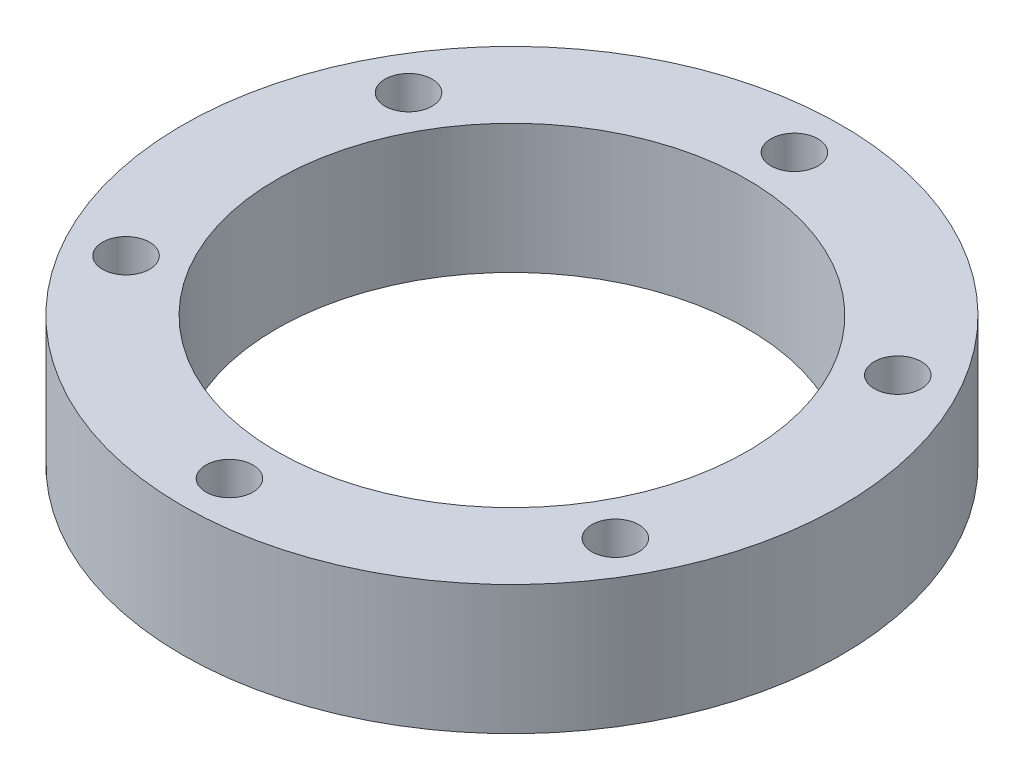
ISO-10303-21;
HEADER;
FILE_DESCRIPTION(('STEP AP214'),'2;1');
FILE_NAME('part.step','',(''),(''),'','','');
FILE_SCHEMA(('AUTOMOTIVE_DESIGN { 1 0 10303 214 1 1 1 1 }'));
ENDSEC;
DATA;
#1=APPLICATION_CONTEXT('core data for automotive mechanical design processes');
#2=APPLICATION_PROTOCOL_DEFINITION('international standard','automotive_design',2000,#1);
#3=PRODUCT_CONTEXT('',#1,'mechanical');
#4=PRODUCT('Part','Part','',(#3));
#5=PRODUCT_RELATED_PRODUCT_CATEGORY('part','',(#4));
#6=PRODUCT_DEFINITION_FORMATION('','',#4);
#7=PRODUCT_DEFINITION_CONTEXT('part definition',#1,'design');
#8=PRODUCT_DEFINITION('design','',#6,#7);
#9=PRODUCT_DEFINITION_SHAPE('','',#8);
#10=(LENGTH_UNIT() NAMED_UNIT(*) SI_UNIT(.MILLI.,.METRE.));
#11=(NAMED_UNIT(*) PLANE_ANGLE_UNIT() SI_UNIT($,.RADIAN.));
#12=(NAMED_UNIT(*) SI_UNIT($,.STERADIAN.) SOLID_ANGLE_UNIT());
#13=UNCERTAINTY_MEASURE_WITH_UNIT(LENGTH_MEASURE(1.E-05),#10,'distance_accuracy_value','');
#14=(GEOMETRIC_REPRESENTATION_CONTEXT(3) GLOBAL_UNCERTAINTY_ASSIGNED_CONTEXT((#13)) GLOBAL_UNIT_ASSIGNED_CONTEXT((#10,
#11,#12)) REPRESENTATION_CONTEXT('',''));
#15=CARTESIAN_POINT('',(0.,0.,0.));
#16=DIRECTION('',(0.,0.,1.));
#17=DIRECTION('',(1.,0.,0.));
#18=AXIS2_PLACEMENT_3D('',#15,#16,#17);
#19=CARTESIAN_POINT('',(0.,6.86,0.));
#20=DIRECTION('',(0.,-1.,0.));
#21=DIRECTION('',(0.,0.,-1.));
#22=AXIS2_PLACEMENT_3D('',#19,#20,#21);
#23=CYLINDRICAL_SURFACE('',#22,17.5);
#24=CARTESIAN_POINT('',(0.,6.86,0.));
#25=DIRECTION('',(0.,1.,0.));
#26=DIRECTION('',(0.,0.,1.));
#27=AXIS2_PLACEMENT_3D('',#24,#25,#26);
#28=CIRCLE('',#27,17.5);
#29=CARTESIAN_POINT('',(0.,6.86,17.5));
#30=VERTEX_POINT('',#29);
#31=EDGE_CURVE('E10',#30,#30,#28,.T.);
#32=ORIENTED_EDGE('',*,*,#31,.F.);
#33=EDGE_LOOP('',(#32));
#34=FACE_BOUND('',#33,.T.);
#35=CARTESIAN_POINT('',(0.,0.,0.));
#36=DIRECTION('',(0.,1.,0.));
#37=DIRECTION('',(0.,0.,1.));
#38=AXIS2_PLACEMENT_3D('',#35,#36,#37);
#39=CIRCLE('',#38,17.5);
#40=CARTESIAN_POINT('',(0.,0.,17.5));
#41=VERTEX_POINT('',#40);
#42=EDGE_CURVE('E34',#41,#41,#39,.T.);
#43=ORIENTED_EDGE('',*,*,#42,.T.);
#44=EDGE_LOOP('',(#43));
#45=FACE_BOUND('',#44,.T.);
#46=ADVANCED_FACE('F31',(#34,#45),#23,.T.);
#47=CARTESIAN_POINT('',(0.,6.86,0.));
#48=DIRECTION('',(0.,1.,0.));
#49=DIRECTION('',(0.,0.,1.));
#50=AXIS2_PLACEMENT_3D('',#47,#48,#49);
#51=PLANE('',#50);
#52=CARTESIAN_POINT('',(-12.9903810567665,6.86,-7.50000000000015));
#53=DIRECTION('',(0.,1.,0.));
#54=DIRECTION('',(0.866025403784433,0.,0.50000000000001));
#55=AXIS2_PLACEMENT_3D('',#52,#53,#54);
#56=CIRCLE('',#55,1.25);
#57=CARTESIAN_POINT('',(-11.907849302036,6.86,-6.87500000000014));
#58=VERTEX_POINT('',#57);
#59=EDGE_CURVE('E61',#58,#58,#56,.T.);
#60=ORIENTED_EDGE('',*,*,#59,.F.);
#61=EDGE_LOOP('',(#60));
#62=FACE_BOUND('',#61,.T.);
#63=CARTESIAN_POINT('',(-12.9903810567666,6.86,7.49999999999988));
#64=DIRECTION('',(0.,1.,0.));
#65=DIRECTION('',(0.866025403784443,0.,-0.499999999999992));
#66=AXIS2_PLACEMENT_3D('',#63,#64,#65);
#67=CIRCLE('',#66,1.25);
#68=CARTESIAN_POINT('',(-11.9078493020361,6.86,6.87499999999989));
#69=VERTEX_POINT('',#68);
#70=EDGE_CURVE('E67',#69,#69,#67,.T.);
#71=ORIENTED_EDGE('',*,*,#70,.F.);
#72=EDGE_LOOP('',(#71));
#73=FACE_BOUND('',#72,.T.);
#74=CARTESIAN_POINT('',(0.,6.86,15.));
#75=DIRECTION('',(0.,1.,0.));
#76=DIRECTION('',(0.,0.,-1.));
#77=AXIS2_PLACEMENT_3D('',#74,#75,#76);
#78=CIRCLE('',#77,1.25);
#79=CARTESIAN_POINT('',(0.,6.86,13.75));
#80=VERTEX_POINT('',#79);
#81=EDGE_CURVE('E73',#80,#80,#78,.T.);
#82=ORIENTED_EDGE('',*,*,#81,.F.);
#83=EDGE_LOOP('',(#82));
#84=FACE_BOUND('',#83,.T.);
#85=CARTESIAN_POINT('',(12.9903810567665,6.86,7.50000000000006));
#86=DIRECTION('',(0.,1.,0.));
#87=DIRECTION('',(-0.866025403784436,0.,-0.500000000000004));
#88=AXIS2_PLACEMENT_3D('',#85,#86,#87);
#89=CIRCLE('',#88,1.25);
#90=CARTESIAN_POINT('',(11.907849302036,6.86,6.87500000000006));
#91=VERTEX_POINT('',#90);
#92=EDGE_CURVE('E79',#91,#91,#89,.T.);
#93=ORIENTED_EDGE('',*,*,#92,.F.);
#94=EDGE_LOOP('',(#93));
#95=FACE_BOUND('',#94,.T.);
#96=CARTESIAN_POINT('',(12.9903810567666,6.86,-7.49999999999997));
#97=DIRECTION('',(0.,1.,0.));
#98=DIRECTION('',(-0.86602540378444,0.,0.499999999999998));
#99=AXIS2_PLACEMENT_3D('',#96,#97,#98);
#100=CIRCLE('',#99,1.25);
#101=CARTESIAN_POINT('',(11.907849302036,6.86,-6.87499999999997));
#102=VERTEX_POINT('',#101);
#103=EDGE_CURVE('E55',#102,#102,#100,.T.);
#104=ORIENTED_EDGE('',*,*,#103,.F.);
#105=EDGE_LOOP('',(#104));
#106=FACE_BOUND('',#105,.T.);
#107=CARTESIAN_POINT('',(0.,6.86,-15.));
#108=DIRECTION('',(0.,1.,0.));
#109=DIRECTION('',(0.,0.,1.));
#110=AXIS2_PLACEMENT_3D('',#107,#108,#109);
#111=CIRCLE('',#110,1.25);
#112=CARTESIAN_POINT('',(0.,6.86,-13.75));
#113=VERTEX_POINT('',#112);
#114=EDGE_CURVE('E49',#113,#113,#111,.T.);
#115=ORIENTED_EDGE('',*,*,#114,.F.);
#116=EDGE_LOOP('',(#115));
#117=FACE_BOUND('',#116,.T.);
#118=CARTESIAN_POINT('',(0.,6.86,0.));
#119=DIRECTION('',(0.,1.,0.));
#120=DIRECTION('',(0.,0.,1.));
#121=AXIS2_PLACEMENT_3D('',#118,#119,#120);
#122=CIRCLE('',#121,12.5);
#123=CARTESIAN_POINT('',(0.,6.86,12.5));
#124=VERTEX_POINT('',#123);
#125=EDGE_CURVE('E43',#124,#124,#122,.T.);
#126=ORIENTED_EDGE('',*,*,#125,.F.);
#127=EDGE_LOOP('',(#126));
#128=FACE_BOUND('',#127,.T.);
#129=ORIENTED_EDGE('',*,*,#31,.T.);
#130=EDGE_LOOP('',(#129));
#131=FACE_BOUND('',#130,.T.);
#132=ADVANCED_FACE('F96',(#62,#73,#84,#95,#106,#117,#128,#131),#51,.T.);
#133=CARTESIAN_POINT('',(0.,0.,0.));
#134=DIRECTION('',(0.,1.,0.));
#135=DIRECTION('',(0.,0.,1.));
#136=AXIS2_PLACEMENT_3D('',#133,#134,#135);
#137=PLANE('',#136);
#138=CARTESIAN_POINT('',(-12.9903810567665,0.,-7.50000000000015));
#139=DIRECTION('',(0.,1.,0.));
#140=DIRECTION('',(0.866025403784433,0.,0.50000000000001));
#141=AXIS2_PLACEMENT_3D('',#138,#139,#140);
#142=CIRCLE('',#141,1.25);
#143=CARTESIAN_POINT('',(-11.907849302036,0.,-6.87500000000014));
#144=VERTEX_POINT('',#143);
#145=EDGE_CURVE('E64',#144,#144,#142,.T.);
#146=ORIENTED_EDGE('',*,*,#145,.T.);
#147=EDGE_LOOP('',(#146));
#148=FACE_BOUND('',#147,.T.);
#149=CARTESIAN_POINT('',(-12.9903810567666,0.,7.49999999999988));
#150=DIRECTION('',(0.,1.,0.));
#151=DIRECTION('',(0.866025403784443,0.,-0.499999999999992));
#152=AXIS2_PLACEMENT_3D('',#149,#150,#151);
#153=CIRCLE('',#152,1.25);
#154=CARTESIAN_POINT('',(-11.9078493020361,0.,6.87499999999989));
#155=VERTEX_POINT('',#154);
#156=EDGE_CURVE('E70',#155,#155,#153,.T.);
#157=ORIENTED_EDGE('',*,*,#156,.T.);
#158=EDGE_LOOP('',(#157));
#159=FACE_BOUND('',#158,.T.);
#160=CARTESIAN_POINT('',(0.,0.,15.));
#161=DIRECTION('',(0.,1.,0.));
#162=DIRECTION('',(0.,0.,-1.));
#163=AXIS2_PLACEMENT_3D('',#160,#161,#162);
#164=CIRCLE('',#163,1.25);
#165=CARTESIAN_POINT('',(0.,0.,13.75));
#166=VERTEX_POINT('',#165);
#167=EDGE_CURVE('E76',#166,#166,#164,.T.);
#168=ORIENTED_EDGE('',*,*,#167,.T.);
#169=EDGE_LOOP('',(#168));
#170=FACE_BOUND('',#169,.T.);
#171=CARTESIAN_POINT('',(12.9903810567665,0.,7.50000000000006));
#172=DIRECTION('',(0.,1.,0.));
#173=DIRECTION('',(-0.866025403784436,0.,-0.500000000000004));
#174=AXIS2_PLACEMENT_3D('',#171,#172,#173);
#175=CIRCLE('',#174,1.25);
#176=CARTESIAN_POINT('',(11.907849302036,0.,6.87500000000006));
#177=VERTEX_POINT('',#176);
#178=EDGE_CURVE('E58',#177,#177,#175,.T.);
#179=ORIENTED_EDGE('',*,*,#178,.T.);
#180=EDGE_LOOP('',(#179));
#181=FACE_BOUND('',#180,.T.);
#182=CARTESIAN_POINT('',(12.9903810567666,0.,-7.49999999999997));
#183=DIRECTION('',(0.,1.,0.));
#184=DIRECTION('',(-0.86602540378444,0.,0.499999999999998));
#185=AXIS2_PLACEMENT_3D('',#182,#183,#184);
#186=CIRCLE('',#185,1.25);
#187=CARTESIAN_POINT('',(11.907849302036,0.,-6.87499999999997));
#188=VERTEX_POINT('',#187);
#189=EDGE_CURVE('E52',#188,#188,#186,.T.);
#190=ORIENTED_EDGE('',*,*,#189,.T.);
#191=EDGE_LOOP('',(#190));
#192=FACE_BOUND('',#191,.T.);
#193=CARTESIAN_POINT('',(0.,0.,-15.));
#194=DIRECTION('',(0.,1.,0.));
#195=DIRECTION('',(0.,0.,1.));
#196=AXIS2_PLACEMENT_3D('',#193,#194,#195);
#197=CIRCLE('',#196,1.25);
#198=CARTESIAN_POINT('',(0.,0.,-13.75));
#199=VERTEX_POINT('',#198);
#200=EDGE_CURVE('E46',#199,#199,#197,.T.);
#201=ORIENTED_EDGE('',*,*,#200,.T.);
#202=EDGE_LOOP('',(#201));
#203=FACE_BOUND('',#202,.T.);
#204=CARTESIAN_POINT('',(0.,0.,0.));
#205=DIRECTION('',(0.,1.,0.));
#206=DIRECTION('',(0.,0.,1.));
#207=AXIS2_PLACEMENT_3D('',#204,#205,#206);
#208=CIRCLE('',#207,12.5);
#209=CARTESIAN_POINT('',(0.,0.,12.5));
#210=VERTEX_POINT('',#209);
#211=EDGE_CURVE('E41',#210,#210,#208,.T.);
#212=ORIENTED_EDGE('',*,*,#211,.T.);
#213=EDGE_LOOP('',(#212));
#214=FACE_BOUND('',#213,.T.);
#215=ORIENTED_EDGE('',*,*,#42,.F.);
#216=EDGE_LOOP('',(#215));
#217=FACE_BOUND('',#216,.T.);
#218=ADVANCED_FACE('F85',(#148,#159,#170,#181,#192,#203,#214,#217),#137,.F.);
#219=CARTESIAN_POINT('',(0.,0.,0.));
#220=DIRECTION('',(0.,1.,0.));
#221=DIRECTION('',(0.,0.,1.));
#222=AXIS2_PLACEMENT_3D('',#219,#220,#221);
#223=CYLINDRICAL_SURFACE('',#222,12.5);
#224=ORIENTED_EDGE('',*,*,#211,.F.);
#225=EDGE_LOOP('',(#224));
#226=FACE_BOUND('',#225,.T.);
#227=ORIENTED_EDGE('',*,*,#125,.T.);
#228=EDGE_LOOP('',(#227));
#229=FACE_BOUND('',#228,.T.);
#230=ADVANCED_FACE('F107',(#226,#229),#223,.F.);
#231=CARTESIAN_POINT('',(0.,0.,-15.));
#232=DIRECTION('',(0.,1.,0.));
#233=DIRECTION('',(0.,0.,1.));
#234=AXIS2_PLACEMENT_3D('',#231,#232,#233);
#235=CYLINDRICAL_SURFACE('',#234,1.25);
#236=ORIENTED_EDGE('',*,*,#200,.F.);
#237=EDGE_LOOP('',(#236));
#238=FACE_BOUND('',#237,.T.);
#239=ORIENTED_EDGE('',*,*,#114,.T.);
#240=EDGE_LOOP('',(#239));
#241=FACE_BOUND('',#240,.T.);
#242=ADVANCED_FACE('F109',(#238,#241),#235,.F.);
#243=CARTESIAN_POINT('',(12.9903810567666,0.,-7.49999999999997));
#244=DIRECTION('',(0.,1.,0.));
#245=DIRECTION('',(0.,0.,1.));
#246=AXIS2_PLACEMENT_3D('',#243,#244,#245);
#247=CYLINDRICAL_SURFACE('',#246,1.25);
#248=ORIENTED_EDGE('',*,*,#189,.F.);
#249=EDGE_LOOP('',(#248));
#250=FACE_BOUND('',#249,.T.);
#251=ORIENTED_EDGE('',*,*,#103,.T.);
#252=EDGE_LOOP('',(#251));
#253=FACE_BOUND('',#252,.T.);
#254=ADVANCED_FACE('F92',(#250,#253),#247,.F.);
#255=CARTESIAN_POINT('',(12.9903810567665,0.,7.50000000000006));
#256=DIRECTION('',(0.,1.,0.));
#257=DIRECTION('',(0.,0.,1.));
#258=AXIS2_PLACEMENT_3D('',#255,#256,#257);
#259=CYLINDRICAL_SURFACE('',#258,1.25);
#260=ORIENTED_EDGE('',*,*,#178,.F.);
#261=EDGE_LOOP('',(#260));
#262=FACE_BOUND('',#261,.T.);
#263=ORIENTED_EDGE('',*,*,#92,.T.);
#264=EDGE_LOOP('',(#263));
#265=FACE_BOUND('',#264,.T.);
#266=ADVANCED_FACE('F88',(#262,#265),#259,.F.);
#267=CARTESIAN_POINT('',(0.,0.,15.));
#268=DIRECTION('',(0.,1.,0.));
#269=DIRECTION('',(0.,0.,1.));
#270=AXIS2_PLACEMENT_3D('',#267,#268,#269);
#271=CYLINDRICAL_SURFACE('',#270,1.25);
#272=ORIENTED_EDGE('',*,*,#167,.F.);
#273=EDGE_LOOP('',(#272));
#274=FACE_BOUND('',#273,.T.);
#275=ORIENTED_EDGE('',*,*,#81,.T.);
#276=EDGE_LOOP('',(#275));
#277=FACE_BOUND('',#276,.T.);
#278=ADVANCED_FACE('F91',(#274,#277),#271,.F.);
#279=CARTESIAN_POINT('',(-12.9903810567666,0.,7.49999999999988));
#280=DIRECTION('',(0.,1.,0.));
#281=DIRECTION('',(0.,0.,1.));
#282=AXIS2_PLACEMENT_3D('',#279,#280,#281);
#283=CYLINDRICAL_SURFACE('',#282,1.25);
#284=ORIENTED_EDGE('',*,*,#156,.F.);
#285=EDGE_LOOP('',(#284));
#286=FACE_BOUND('',#285,.T.);
#287=ORIENTED_EDGE('',*,*,#70,.T.);
#288=EDGE_LOOP('',(#287));
#289=FACE_BOUND('',#288,.T.);
#290=ADVANCED_FACE('F162',(#286,#289),#283,.F.);
#291=CARTESIAN_POINT('',(-12.9903810567665,0.,-7.50000000000015));
#292=DIRECTION('',(0.,1.,0.));
#293=DIRECTION('',(0.,0.,1.));
#294=AXIS2_PLACEMENT_3D('',#291,#292,#293);
#295=CYLINDRICAL_SURFACE('',#294,1.25);
#296=ORIENTED_EDGE('',*,*,#145,.F.);
#297=EDGE_LOOP('',(#296));
#298=FACE_BOUND('',#297,.T.);
#299=ORIENTED_EDGE('',*,*,#59,.T.);
#300=EDGE_LOOP('',(#299));
#301=FACE_BOUND('',#300,.T.);
#302=ADVANCED_FACE('F172',(#298,#301),#295,.F.);
#303=CLOSED_SHELL('',(#46,#132,#218,#230,#242,#254,#266,#278,#290,#302));
#304=MANIFOLD_SOLID_BREP('B2',#303);
#305=ADVANCED_BREP_SHAPE_REPRESENTATION('',(#18,#304),#14);
#306=SHAPE_DEFINITION_REPRESENTATION(#9,#305);
ENDSEC;
END-ISO-10303-21;
